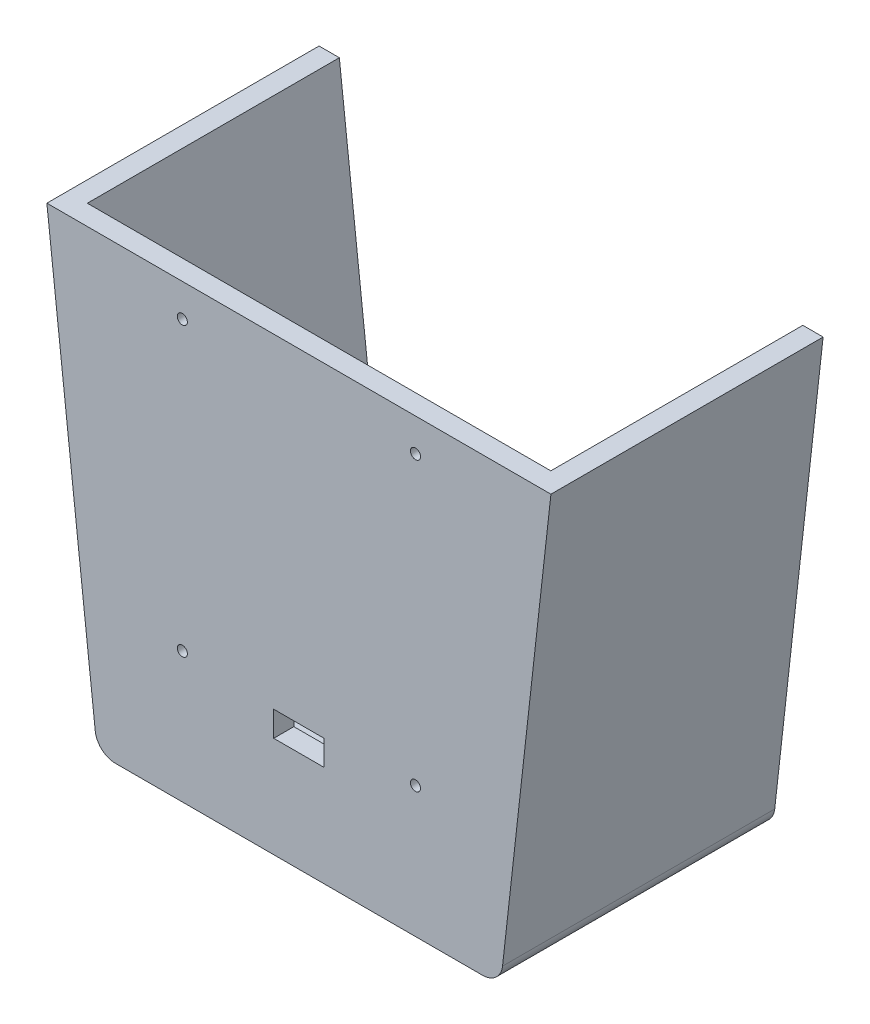
ISO-10303-21;
HEADER;
FILE_DESCRIPTION(('STEP AP214'),'2;1');
FILE_NAME('part.step','',(''),(''),'','','');
FILE_SCHEMA(('AUTOMOTIVE_DESIGN { 1 0 10303 214 1 1 1 1 }'));
ENDSEC;
DATA;
#1=APPLICATION_CONTEXT('core data for automotive mechanical design processes');
#2=APPLICATION_PROTOCOL_DEFINITION('international standard','automotive_design',2000,#1);
#3=PRODUCT_CONTEXT('',#1,'mechanical');
#4=PRODUCT('Part','Part','',(#3));
#5=PRODUCT_RELATED_PRODUCT_CATEGORY('part','',(#4));
#6=PRODUCT_DEFINITION_FORMATION('','',#4);
#7=PRODUCT_DEFINITION_CONTEXT('part definition',#1,'design');
#8=PRODUCT_DEFINITION('design','',#6,#7);
#9=PRODUCT_DEFINITION_SHAPE('','',#8);
#10=(LENGTH_UNIT() NAMED_UNIT(*) SI_UNIT(.MILLI.,.METRE.));
#11=(NAMED_UNIT(*) PLANE_ANGLE_UNIT() SI_UNIT($,.RADIAN.));
#12=(NAMED_UNIT(*) SI_UNIT($,.STERADIAN.) SOLID_ANGLE_UNIT());
#13=UNCERTAINTY_MEASURE_WITH_UNIT(LENGTH_MEASURE(1.E-05),#10,'distance_accuracy_value','');
#14=(GEOMETRIC_REPRESENTATION_CONTEXT(3) GLOBAL_UNCERTAINTY_ASSIGNED_CONTEXT((#13)) GLOBAL_UNIT_ASSIGNED_CONTEXT((#10,
#11,#12)) REPRESENTATION_CONTEXT('',''));
#15=CARTESIAN_POINT('',(0.,0.,0.));
#16=DIRECTION('',(0.,0.,1.));
#17=DIRECTION('',(1.,0.,0.));
#18=AXIS2_PLACEMENT_3D('',#15,#16,#17);
#19=CARTESIAN_POINT('',(46.2563098697204,-51.7161260569893,-5.08));
#20=DIRECTION('',(0.,0.,-1.));
#21=DIRECTION('',(-1.,0.,0.));
#22=AXIS2_PLACEMENT_3D('',#19,#20,#21);
#23=PLANE('',#22);
#24=CARTESIAN_POINT('',(-29.36937484,48.5411272,-5.08));
#25=DIRECTION('',(0.,0.,1.));
#26=DIRECTION('',(-1.,0.,0.));
#27=AXIS2_PLACEMENT_3D('',#24,#25,#26);
#28=CIRCLE('',#27,1.27);
#29=CARTESIAN_POINT('',(-30.63937484,48.5411272,-5.08));
#30=VERTEX_POINT('',#29);
#31=EDGE_CURVE('E774',#30,#30,#28,.T.);
#32=ORIENTED_EDGE('',*,*,#31,.T.);
#33=EDGE_LOOP('',(#32));
#34=FACE_BOUND('',#33,.T.);
#35=CARTESIAN_POINT('',(29.36937484,-23.8488716569893,-5.08));
#36=DIRECTION('',(0.,0.,1.));
#37=DIRECTION('',(-1.,0.,0.));
#38=AXIS2_PLACEMENT_3D('',#35,#36,#37);
#39=CIRCLE('',#38,1.27);
#40=CARTESIAN_POINT('',(28.09937484,-23.8488716569893,-5.08));
#41=VERTEX_POINT('',#40);
#42=EDGE_CURVE('E779',#41,#41,#39,.T.);
#43=ORIENTED_EDGE('',*,*,#42,.T.);
#44=EDGE_LOOP('',(#43));
#45=FACE_BOUND('',#44,.T.);
#46=CARTESIAN_POINT('',(-29.36937484,-23.8488716569893,-5.08));
#47=DIRECTION('',(0.,0.,1.));
#48=DIRECTION('',(1.,0.,0.));
#49=AXIS2_PLACEMENT_3D('',#46,#47,#48);
#50=CIRCLE('',#49,1.27);
#51=CARTESIAN_POINT('',(-28.09937484,-23.8488716569893,-5.08));
#52=VERTEX_POINT('',#51);
#53=EDGE_CURVE('E793',#52,#52,#50,.T.);
#54=ORIENTED_EDGE('',*,*,#53,.T.);
#55=EDGE_LOOP('',(#54));
#56=FACE_BOUND('',#55,.T.);
#57=CARTESIAN_POINT('',(29.36937484,48.5411272,-5.08));
#58=DIRECTION('',(0.,0.,1.));
#59=DIRECTION('',(1.,0.,0.));
#60=AXIS2_PLACEMENT_3D('',#57,#58,#59);
#61=CIRCLE('',#60,1.27);
#62=CARTESIAN_POINT('',(30.63937484,48.5411272,-5.08));
#63=VERTEX_POINT('',#62);
#64=EDGE_CURVE('E794',#63,#63,#61,.T.);
#65=ORIENTED_EDGE('',*,*,#64,.T.);
#66=EDGE_LOOP('',(#65));
#67=FACE_BOUND('',#66,.T.);
#68=DIRECTION('',(0.,-1.,0.));
#69=VECTOR('',#68,1.);
#70=CARTESIAN_POINT('',(-6.34999999999999,-25.0461260569893,-5.08));
#71=LINE('',#70,#69);
#72=CARTESIAN_POINT('',(-6.34999999999999,-25.0461260569893,-5.08));
#73=VERTEX_POINT('',#72);
#74=CARTESIAN_POINT('',(-6.34999999999999,-31.3961260569893,-5.08));
#75=VERTEX_POINT('',#74);
#76=EDGE_CURVE('E335',#73,#75,#71,.T.);
#77=ORIENTED_EDGE('',*,*,#76,.T.);
#78=DIRECTION('',(1.,0.,0.));
#79=VECTOR('',#78,1.);
#80=CARTESIAN_POINT('',(-6.34999999999999,-31.3961260569893,-5.08));
#81=LINE('',#80,#79);
#82=CARTESIAN_POINT('',(6.35000000000001,-31.3961260569893,-5.08));
#83=VERTEX_POINT('',#82);
#84=EDGE_CURVE('E339',#75,#83,#81,.T.);
#85=ORIENTED_EDGE('',*,*,#84,.T.);
#86=DIRECTION('',(0.,1.,0.));
#87=VECTOR('',#86,1.);
#88=CARTESIAN_POINT('',(6.35000000000001,-25.0461260569893,-5.08));
#89=LINE('',#88,#87);
#90=CARTESIAN_POINT('',(6.35000000000001,-25.0461260569893,-5.08));
#91=VERTEX_POINT('',#90);
#92=EDGE_CURVE('E344',#83,#91,#89,.T.);
#93=ORIENTED_EDGE('',*,*,#92,.T.);
#94=DIRECTION('',(-1.,0.,0.));
#95=VECTOR('',#94,1.);
#96=CARTESIAN_POINT('',(6.35000000000001,-25.0461260569893,-5.08));
#97=LINE('',#96,#95);
#98=EDGE_CURVE('E348',#91,#73,#97,.T.);
#99=ORIENTED_EDGE('',*,*,#98,.T.);
#100=EDGE_LOOP('',(#77,#85,#93,#99));
#101=FACE_BOUND('',#100,.T.);
#102=DIRECTION('',(-1.,0.,0.));
#103=VECTOR('',#102,1.);
#104=CARTESIAN_POINT('',(63.5,56.7961272,-5.08));
#105=LINE('',#104,#103);
#106=CARTESIAN_POINT('',(58.3883486034355,56.7961272,-5.08));
#107=VERTEX_POINT('',#106);
#108=CARTESIAN_POINT('',(-58.3883486034355,56.7961272,-5.08));
#109=VERTEX_POINT('',#108);
#110=EDGE_CURVE('E379',#107,#109,#105,.T.);
#111=ORIENTED_EDGE('',*,*,#110,.F.);
#112=DIRECTION('',(-0.111111111111111,-0.993807989999907,0.));
#113=VECTOR('',#112,1.);
#114=CARTESIAN_POINT('',(51.3958997921375,-5.74623628499934,-5.08));
#115=LINE('',#114,#113);
#116=CARTESIAN_POINT('',(46.7611643286404,-47.2005705014338,-5.08));
#117=VERTEX_POINT('',#116);
#118=EDGE_CURVE('E254',#107,#117,#115,.T.);
#119=ORIENTED_EDGE('',*,*,#118,.T.);
#120=CARTESIAN_POINT('',(41.7126197394409,-46.6361260569893,-5.08));
#121=DIRECTION('',(0.,0.,-1.));
#122=DIRECTION('',(-1.,0.,0.));
#123=AXIS2_PLACEMENT_3D('',#120,#121,#122);
#124=CIRCLE('',#123,5.08000000000001);
#125=CARTESIAN_POINT('',(41.7126197394409,-51.7161260569893,-5.08));
#126=VERTEX_POINT('',#125);
#127=EDGE_CURVE('E306',#117,#126,#124,.T.);
#128=ORIENTED_EDGE('',*,*,#127,.T.);
#129=DIRECTION('',(-1.,0.,0.));
#130=VECTOR('',#129,1.);
#131=CARTESIAN_POINT('',(0.,-51.7161260569893,-5.08));
#132=LINE('',#131,#130);
#133=CARTESIAN_POINT('',(-41.7126197394408,-51.7161260569893,-5.08));
#134=VERTEX_POINT('',#133);
#135=EDGE_CURVE('E303',#126,#134,#132,.T.);
#136=ORIENTED_EDGE('',*,*,#135,.T.);
#137=CARTESIAN_POINT('',(-41.7126197394408,-46.6361260569893,-5.08));
#138=DIRECTION('',(0.,0.,-1.));
#139=DIRECTION('',(-1.,0.,0.));
#140=AXIS2_PLACEMENT_3D('',#137,#138,#139);
#141=CIRCLE('',#140,5.08000000000001);
#142=CARTESIAN_POINT('',(-46.7611643286404,-47.2005705014338,-5.08));
#143=VERTEX_POINT('',#142);
#144=EDGE_CURVE('E299',#143,#134,#141,.F.);
#145=ORIENTED_EDGE('',*,*,#144,.F.);
#146=DIRECTION('',(0.111111111111111,-0.993807989999907,0.));
#147=VECTOR('',#146,1.);
#148=CARTESIAN_POINT('',(-51.3958997921375,-5.74623628499934,-5.08));
#149=LINE('',#148,#147);
#150=EDGE_CURVE('E248',#109,#143,#149,.T.);
#151=ORIENTED_EDGE('',*,*,#150,.F.);
#152=EDGE_LOOP('',(#111,#119,#128,#136,#145,#151));
#153=FACE_BOUND('',#152,.T.);
#154=DIRECTION('',(0.,-1.,0.));
#155=VECTOR('',#154,1.);
#156=CARTESIAN_POINT('',(20.3199970034355,44.0961272,-5.08));
#157=LINE('',#156,#155);
#158=CARTESIAN_POINT('',(20.3199970034355,44.0961272,-5.08));
#159=VERTEX_POINT('',#158);
#160=CARTESIAN_POINT('',(20.3199970034355,-19.4038728,-5.08));
#161=VERTEX_POINT('',#160);
#162=EDGE_CURVE('E221',#159,#161,#157,.T.);
#163=ORIENTED_EDGE('',*,*,#162,.F.);
#164=DIRECTION('',(0.539053696423367,0.842271400661511,0.));
#165=VECTOR('',#164,1.);
#166=CARTESIAN_POINT('',(20.3199970034355,44.0961272,-5.08));
#167=LINE('',#166,#165);
#168=CARTESIAN_POINT('',(17.7799970034355,40.1273772,-5.08));
#169=VERTEX_POINT('',#168);
#170=EDGE_CURVE('E213',#169,#159,#167,.T.);
#171=ORIENTED_EDGE('',*,*,#170,.F.);
#172=DIRECTION('',(0.,-1.,0.));
#173=VECTOR('',#172,1.);
#174=CARTESIAN_POINT('',(17.7799970034355,-16.8638728,-5.08));
#175=LINE('',#174,#173);
#176=CARTESIAN_POINT('',(17.7799970034355,-16.8638728,-5.08));
#177=VERTEX_POINT('',#176);
#178=EDGE_CURVE('E195',#169,#177,#175,.T.);
#179=ORIENTED_EDGE('',*,*,#178,.T.);
#180=DIRECTION('',(-1.,0.,0.));
#181=VECTOR('',#180,1.);
#182=CARTESIAN_POINT('',(-18.6944029965645,-16.8638728,-5.08));
#183=LINE('',#182,#181);
#184=CARTESIAN_POINT('',(-18.6944029965645,-16.8638728,-5.08));
#185=VERTEX_POINT('',#184);
#186=EDGE_CURVE('E206',#177,#185,#183,.T.);
#187=ORIENTED_EDGE('',*,*,#186,.T.);
#188=CARTESIAN_POINT('',(-20.3200029965645,-19.4038728,-5.08));
#189=VERTEX_POINT('',#188);
#190=EDGE_CURVE('E223',#189,#185,#167,.T.);
#191=ORIENTED_EDGE('',*,*,#190,.F.);
#192=DIRECTION('',(-1.,0.,0.));
#193=VECTOR('',#192,1.);
#194=CARTESIAN_POINT('',(20.3199970034355,-19.4038728,-5.08));
#195=LINE('',#194,#193);
#196=EDGE_CURVE('E235',#161,#189,#195,.T.);
#197=ORIENTED_EDGE('',*,*,#196,.F.);
#198=EDGE_LOOP('',(#163,#171,#179,#187,#191,#197));
#199=FACE_BOUND('',#198,.T.);
#200=ADVANCED_FACE('F43',(#34,#45,#56,#67,#101,#153,#199),#23,.T.);
#201=CARTESIAN_POINT('',(46.2563098697204,-51.7161260569893,-5.08));
#202=DIRECTION('',(0.,0.,1.));
#203=DIRECTION('',(1.,0.,0.));
#204=AXIS2_PLACEMENT_3D('',#201,#202,#203);
#205=CYLINDRICAL_SURFACE('',#204,5.08);
#206=CARTESIAN_POINT('',(46.2563098697204,-51.7161260569893,0.));
#207=DIRECTION('',(0.,0.,1.));
#208=DIRECTION('',(-1.,0.,0.));
#209=AXIS2_PLACEMENT_3D('',#206,#207,#208);
#210=CIRCLE('',#209,5.08);
#211=CARTESIAN_POINT('',(46.2563098697204,-56.7961260569893,0.));
#212=VERTEX_POINT('',#211);
#213=CARTESIAN_POINT('',(51.30485445892,-52.2805705014337,0.));
#214=VERTEX_POINT('',#213);
#215=EDGE_CURVE('E369',#212,#214,#210,.T.);
#216=ORIENTED_EDGE('',*,*,#215,.F.);
#217=DIRECTION('',(0.,0.,1.));
#218=VECTOR('',#217,1.);
#219=CARTESIAN_POINT('',(46.2563098697204,-56.7961260569893,-5.08));
#220=LINE('',#219,#218);
#221=CARTESIAN_POINT('',(46.2563098697204,-56.7961260569893,-68.58));
#222=VERTEX_POINT('',#221);
#223=EDGE_CURVE('E11',#222,#212,#220,.T.);
#224=ORIENTED_EDGE('',*,*,#223,.F.);
#225=CARTESIAN_POINT('',(46.2563098697204,-51.7161260569893,-68.58));
#226=DIRECTION('',(0.,0.,-1.));
#227=DIRECTION('',(-1.,0.,0.));
#228=AXIS2_PLACEMENT_3D('',#225,#226,#227);
#229=CIRCLE('',#228,5.08);
#230=CARTESIAN_POINT('',(51.30485445892,-52.2805705014338,-68.58));
#231=VERTEX_POINT('',#230);
#232=EDGE_CURVE('E291',#231,#222,#229,.T.);
#233=ORIENTED_EDGE('',*,*,#232,.F.);
#234=DIRECTION('',(0.,0.,1.));
#235=VECTOR('',#234,1.);
#236=CARTESIAN_POINT('',(51.30485445892,-52.2805705014337,-5.08));
#237=LINE('',#236,#235);
#238=EDGE_CURVE('E47',#231,#214,#237,.T.);
#239=ORIENTED_EDGE('',*,*,#238,.T.);
#240=EDGE_LOOP('',(#216,#224,#233,#239));
#241=FACE_BOUND('',#240,.T.);
#242=ADVANCED_FACE('F45',(#241),#205,.T.);
#243=CARTESIAN_POINT('',(-46.2563098697204,-56.7961260569893,-5.08));
#244=DIRECTION('',(0.,-1.,0.));
#245=DIRECTION('',(0.,0.,-1.));
#246=AXIS2_PLACEMENT_3D('',#243,#244,#245);
#247=PLANE('',#246);
#248=DIRECTION('',(1.,0.,0.));
#249=VECTOR('',#248,1.);
#250=CARTESIAN_POINT('',(-46.2563098697204,-56.7961260569893,0.));
#251=LINE('',#250,#249);
#252=CARTESIAN_POINT('',(-46.2563098697204,-56.7961260569893,0.));
#253=VERTEX_POINT('',#252);
#254=EDGE_CURVE('E383',#253,#212,#251,.T.);
#255=ORIENTED_EDGE('',*,*,#254,.F.);
#256=DIRECTION('',(0.,0.,1.));
#257=VECTOR('',#256,1.);
#258=CARTESIAN_POINT('',(-46.2563098697204,-56.7961260569893,-5.08));
#259=LINE('',#258,#257);
#260=CARTESIAN_POINT('',(-46.2563098697204,-56.7961260569893,-68.58));
#261=VERTEX_POINT('',#260);
#262=EDGE_CURVE('E53',#261,#253,#259,.T.);
#263=ORIENTED_EDGE('',*,*,#262,.F.);
#264=DIRECTION('',(-1.,0.,0.));
#265=VECTOR('',#264,1.);
#266=CARTESIAN_POINT('',(0.,-56.7961260569893,-68.58));
#267=LINE('',#266,#265);
#268=EDGE_CURVE('E249',#222,#261,#267,.T.);
#269=ORIENTED_EDGE('',*,*,#268,.F.);
#270=ORIENTED_EDGE('',*,*,#223,.T.);
#271=EDGE_LOOP('',(#255,#263,#269,#270));
#272=FACE_BOUND('',#271,.T.);
#273=ADVANCED_FACE('F429',(#272),#247,.T.);
#274=CARTESIAN_POINT('',(-46.2563098697204,-51.7161260569893,-5.08));
#275=DIRECTION('',(0.,0.,1.));
#276=DIRECTION('',(1.,0.,0.));
#277=AXIS2_PLACEMENT_3D('',#274,#275,#276);
#278=CYLINDRICAL_SURFACE('',#277,5.08);
#279=CARTESIAN_POINT('',(-46.2563098697204,-51.7161260569893,0.));
#280=DIRECTION('',(0.,0.,1.));
#281=DIRECTION('',(1.,0.,0.));
#282=AXIS2_PLACEMENT_3D('',#279,#280,#281);
#283=CIRCLE('',#282,5.08);
#284=CARTESIAN_POINT('',(-51.3048544589199,-52.2805705014337,0.));
#285=VERTEX_POINT('',#284);
#286=EDGE_CURVE('E399',#285,#253,#283,.T.);
#287=ORIENTED_EDGE('',*,*,#286,.F.);
#288=DIRECTION('',(0.,0.,1.));
#289=VECTOR('',#288,1.);
#290=CARTESIAN_POINT('',(-51.3048544589199,-52.2805705014337,-5.08));
#291=LINE('',#290,#289);
#292=CARTESIAN_POINT('',(-51.3048544589199,-52.2805705014337,-68.58));
#293=VERTEX_POINT('',#292);
#294=EDGE_CURVE('E408',#293,#285,#291,.T.);
#295=ORIENTED_EDGE('',*,*,#294,.F.);
#296=CARTESIAN_POINT('',(-46.2563098697204,-51.7161260569893,-68.58));
#297=DIRECTION('',(0.,0.,-1.));
#298=DIRECTION('',(-1.,0.,0.));
#299=AXIS2_PLACEMENT_3D('',#296,#297,#298);
#300=CIRCLE('',#299,5.08);
#301=EDGE_CURVE('E253',#261,#293,#300,.T.);
#302=ORIENTED_EDGE('',*,*,#301,.F.);
#303=ORIENTED_EDGE('',*,*,#262,.T.);
#304=EDGE_LOOP('',(#287,#295,#302,#303));
#305=FACE_BOUND('',#304,.T.);
#306=ADVANCED_FACE('F446',(#305),#278,.T.);
#307=CARTESIAN_POINT('',(-63.5,56.7961272,-5.08));
#308=DIRECTION('',(-0.993807989999906,-0.111111111111111,0.));
#309=DIRECTION('',(0.111111111111111,-0.993807989999906,0.));
#310=AXIS2_PLACEMENT_3D('',#307,#308,#309);
#311=PLANE('',#310);
#312=DIRECTION('',(0.111111111111111,-0.993807989999906,0.));
#313=VECTOR('',#312,1.);
#314=CARTESIAN_POINT('',(-63.5,56.7961272,0.));
#315=LINE('',#314,#313);
#316=CARTESIAN_POINT('',(-63.5,56.7961272,0.));
#317=VERTEX_POINT('',#316);
#318=EDGE_CURVE('E395',#317,#285,#315,.T.);
#319=ORIENTED_EDGE('',*,*,#318,.F.);
#320=DIRECTION('',(0.,0.,1.));
#321=VECTOR('',#320,1.);
#322=CARTESIAN_POINT('',(-63.5,56.7961272,-5.08));
#323=LINE('',#322,#321);
#324=CARTESIAN_POINT('',(-63.5,56.7961272,-68.58));
#325=VERTEX_POINT('',#324);
#326=EDGE_CURVE('E411',#325,#317,#323,.T.);
#327=ORIENTED_EDGE('',*,*,#326,.F.);
#328=DIRECTION('',(-0.111111111111111,0.993807989999907,0.));
#329=VECTOR('',#328,1.);
#330=CARTESIAN_POINT('',(-56.444444381337,-6.31068072944379,-68.58));
#331=LINE('',#330,#329);
#332=EDGE_CURVE('E258',#293,#325,#331,.T.);
#333=ORIENTED_EDGE('',*,*,#332,.F.);
#334=ORIENTED_EDGE('',*,*,#294,.T.);
#335=EDGE_LOOP('',(#319,#327,#333,#334));
#336=FACE_BOUND('',#335,.T.);
#337=ADVANCED_FACE('F443',(#336),#311,.T.);
#338=CARTESIAN_POINT('',(63.5,56.7961272,-5.08));
#339=DIRECTION('',(0.,1.,0.));
#340=DIRECTION('',(-1.,0.,0.));
#341=AXIS2_PLACEMENT_3D('',#338,#339,#340);
#342=PLANE('',#341);
#343=DIRECTION('',(-1.,0.,0.));
#344=VECTOR('',#343,1.);
#345=CARTESIAN_POINT('',(63.5,56.7961272,0.));
#346=LINE('',#345,#344);
#347=CARTESIAN_POINT('',(63.5,56.7961272,0.));
#348=VERTEX_POINT('',#347);
#349=EDGE_CURVE('E391',#348,#317,#346,.T.);
#350=ORIENTED_EDGE('',*,*,#349,.F.);
#351=DIRECTION('',(0.,0.,1.));
#352=VECTOR('',#351,1.);
#353=CARTESIAN_POINT('',(63.5,56.7961272,-5.08));
#354=LINE('',#353,#352);
#355=CARTESIAN_POINT('',(63.5,56.7961272,-68.58));
#356=VERTEX_POINT('',#355);
#357=EDGE_CURVE('E413',#356,#348,#354,.T.);
#358=ORIENTED_EDGE('',*,*,#357,.F.);
#359=DIRECTION('',(1.,0.,0.));
#360=VECTOR('',#359,1.);
#361=CARTESIAN_POINT('',(0.,56.7961272,-68.58));
#362=LINE('',#361,#360);
#363=CARTESIAN_POINT('',(58.3883486034355,56.7961272,-68.58));
#364=VERTEX_POINT('',#363);
#365=EDGE_CURVE('E283',#364,#356,#362,.T.);
#366=ORIENTED_EDGE('',*,*,#365,.F.);
#367=DIRECTION('',(0.,0.,1.));
#368=VECTOR('',#367,1.);
#369=CARTESIAN_POINT('',(58.3883486034355,56.7961272,-68.58));
#370=LINE('',#369,#368);
#371=EDGE_CURVE('E295',#364,#107,#370,.T.);
#372=ORIENTED_EDGE('',*,*,#371,.T.);
#373=ORIENTED_EDGE('',*,*,#110,.T.);
#374=DIRECTION('',(0.,0.,1.));
#375=VECTOR('',#374,1.);
#376=CARTESIAN_POINT('',(-58.3883486034355,56.7961272,-68.58));
#377=LINE('',#376,#375);
#378=CARTESIAN_POINT('',(-58.3883486034355,56.7961272,-68.58));
#379=VERTEX_POINT('',#378);
#380=EDGE_CURVE('E330',#379,#109,#377,.T.);
#381=ORIENTED_EDGE('',*,*,#380,.F.);
#382=DIRECTION('',(1.,0.,0.));
#383=VECTOR('',#382,1.);
#384=CARTESIAN_POINT('',(0.,56.7961272,-68.58));
#385=LINE('',#384,#383);
#386=EDGE_CURVE('E262',#325,#379,#385,.T.);
#387=ORIENTED_EDGE('',*,*,#386,.F.);
#388=ORIENTED_EDGE('',*,*,#326,.T.);
#389=EDGE_LOOP('',(#350,#358,#366,#372,#373,#381,#387,#388));
#390=FACE_BOUND('',#389,.T.);
#391=ADVANCED_FACE('F438',(#390),#342,.T.);
#392=CARTESIAN_POINT('',(63.5,56.7961272,-5.08));
#393=DIRECTION('',(0.993807989999906,-0.111111111111111,0.));
#394=DIRECTION('',(0.111111111111111,0.993807989999907,0.));
#395=AXIS2_PLACEMENT_3D('',#392,#393,#394);
#396=PLANE('',#395);
#397=DIRECTION('',(0.111111111111111,0.993807989999907,0.));
#398=VECTOR('',#397,1.);
#399=CARTESIAN_POINT('',(63.5,56.7961272,0.));
#400=LINE('',#399,#398);
#401=EDGE_CURVE('E387',#214,#348,#400,.T.);
#402=ORIENTED_EDGE('',*,*,#401,.F.);
#403=ORIENTED_EDGE('',*,*,#238,.F.);
#404=DIRECTION('',(-0.111111111111111,-0.993807989999907,0.));
#405=VECTOR('',#404,1.);
#406=CARTESIAN_POINT('',(56.444444381337,-6.31068072944378,-68.58));
#407=LINE('',#406,#405);
#408=EDGE_CURVE('E287',#356,#231,#407,.T.);
#409=ORIENTED_EDGE('',*,*,#408,.F.);
#410=ORIENTED_EDGE('',*,*,#357,.T.);
#411=EDGE_LOOP('',(#402,#403,#409,#410));
#412=FACE_BOUND('',#411,.T.);
#413=ADVANCED_FACE('F423',(#412),#396,.T.);
#414=CARTESIAN_POINT('',(46.2563098697204,-51.7161260569893,0.));
#415=DIRECTION('',(0.,0.,-1.));
#416=DIRECTION('',(-1.,0.,0.));
#417=AXIS2_PLACEMENT_3D('',#414,#415,#416);
#418=PLANE('',#417);
#419=CARTESIAN_POINT('',(-29.36937484,48.5411272,0.));
#420=DIRECTION('',(0.,0.,1.));
#421=DIRECTION('',(-1.,0.,0.));
#422=AXIS2_PLACEMENT_3D('',#419,#420,#421);
#423=CIRCLE('',#422,1.27);
#424=CARTESIAN_POINT('',(-30.63937484,48.5411272,0.));
#425=VERTEX_POINT('',#424);
#426=EDGE_CURVE('E777',#425,#425,#423,.T.);
#427=ORIENTED_EDGE('',*,*,#426,.F.);
#428=EDGE_LOOP('',(#427));
#429=FACE_BOUND('',#428,.T.);
#430=CARTESIAN_POINT('',(29.36937484,-23.8488716569893,0.));
#431=DIRECTION('',(0.,0.,1.));
#432=DIRECTION('',(-1.,0.,0.));
#433=AXIS2_PLACEMENT_3D('',#430,#431,#432);
#434=CIRCLE('',#433,1.27);
#435=CARTESIAN_POINT('',(28.09937484,-23.8488716569893,0.));
#436=VERTEX_POINT('',#435);
#437=EDGE_CURVE('E786',#436,#436,#434,.T.);
#438=ORIENTED_EDGE('',*,*,#437,.F.);
#439=EDGE_LOOP('',(#438));
#440=FACE_BOUND('',#439,.T.);
#441=CARTESIAN_POINT('',(-29.36937484,-23.8488716569893,0.));
#442=DIRECTION('',(0.,0.,1.));
#443=DIRECTION('',(1.,0.,0.));
#444=AXIS2_PLACEMENT_3D('',#441,#442,#443);
#445=CIRCLE('',#444,1.27);
#446=CARTESIAN_POINT('',(-28.09937484,-23.8488716569893,0.));
#447=VERTEX_POINT('',#446);
#448=EDGE_CURVE('E839',#447,#447,#445,.T.);
#449=ORIENTED_EDGE('',*,*,#448,.F.);
#450=EDGE_LOOP('',(#449));
#451=FACE_BOUND('',#450,.T.);
#452=CARTESIAN_POINT('',(29.36937484,48.5411272,0.));
#453=DIRECTION('',(0.,0.,1.));
#454=DIRECTION('',(1.,0.,0.));
#455=AXIS2_PLACEMENT_3D('',#452,#453,#454);
#456=CIRCLE('',#455,1.27);
#457=CARTESIAN_POINT('',(30.63937484,48.5411272,0.));
#458=VERTEX_POINT('',#457);
#459=EDGE_CURVE('E783',#458,#458,#456,.T.);
#460=ORIENTED_EDGE('',*,*,#459,.F.);
#461=EDGE_LOOP('',(#460));
#462=FACE_BOUND('',#461,.T.);
#463=DIRECTION('',(1.,0.,0.));
#464=VECTOR('',#463,1.);
#465=CARTESIAN_POINT('',(-6.34999999999999,-31.3961260569893,0.));
#466=LINE('',#465,#464);
#467=CARTESIAN_POINT('',(-6.34999999999999,-31.3961260569893,0.));
#468=VERTEX_POINT('',#467);
#469=CARTESIAN_POINT('',(6.35000000000001,-31.3961260569893,0.));
#470=VERTEX_POINT('',#469);
#471=EDGE_CURVE('E355',#468,#470,#466,.T.);
#472=ORIENTED_EDGE('',*,*,#471,.F.);
#473=DIRECTION('',(0.,-1.,0.));
#474=VECTOR('',#473,1.);
#475=CARTESIAN_POINT('',(-6.34999999999999,-25.0461260569893,0.));
#476=LINE('',#475,#474);
#477=CARTESIAN_POINT('',(-6.34999999999999,-25.0461260569893,0.));
#478=VERTEX_POINT('',#477);
#479=EDGE_CURVE('E334',#478,#468,#476,.T.);
#480=ORIENTED_EDGE('',*,*,#479,.F.);
#481=DIRECTION('',(-1.,0.,0.));
#482=VECTOR('',#481,1.);
#483=CARTESIAN_POINT('',(6.35000000000001,-25.0461260569893,0.));
#484=LINE('',#483,#482);
#485=CARTESIAN_POINT('',(6.35000000000001,-25.0461260569893,0.));
#486=VERTEX_POINT('',#485);
#487=EDGE_CURVE('E340',#486,#478,#484,.T.);
#488=ORIENTED_EDGE('',*,*,#487,.F.);
#489=DIRECTION('',(0.,1.,0.));
#490=VECTOR('',#489,1.);
#491=CARTESIAN_POINT('',(6.35000000000001,-25.0461260569893,0.));
#492=LINE('',#491,#490);
#493=EDGE_CURVE('E359',#470,#486,#492,.T.);
#494=ORIENTED_EDGE('',*,*,#493,.F.);
#495=EDGE_LOOP('',(#472,#480,#488,#494));
#496=FACE_BOUND('',#495,.T.);
#497=ORIENTED_EDGE('',*,*,#215,.T.);
#498=ORIENTED_EDGE('',*,*,#401,.T.);
#499=ORIENTED_EDGE('',*,*,#349,.T.);
#500=ORIENTED_EDGE('',*,*,#318,.T.);
#501=ORIENTED_EDGE('',*,*,#286,.T.);
#502=ORIENTED_EDGE('',*,*,#254,.T.);
#503=EDGE_LOOP('',(#497,#498,#499,#500,#501,#502));
#504=FACE_BOUND('',#503,.T.);
#505=ADVANCED_FACE('F425',(#429,#440,#451,#462,#496,#504),#418,.F.);
#506=CARTESIAN_POINT('',(-6.34999999999999,-25.0461260569893,-5.08));
#507=DIRECTION('',(-1.,0.,0.));
#508=DIRECTION('',(0.,-1.,0.));
#509=AXIS2_PLACEMENT_3D('',#506,#507,#508);
#510=PLANE('',#509);
#511=ORIENTED_EDGE('',*,*,#479,.T.);
#512=DIRECTION('',(0.,0.,1.));
#513=VECTOR('',#512,1.);
#514=CARTESIAN_POINT('',(-6.34999999999999,-31.3961260569893,-5.08));
#515=LINE('',#514,#513);
#516=EDGE_CURVE('E352',#75,#468,#515,.T.);
#517=ORIENTED_EDGE('',*,*,#516,.F.);
#518=ORIENTED_EDGE('',*,*,#76,.F.);
#519=DIRECTION('',(0.,0.,1.));
#520=VECTOR('',#519,1.);
#521=CARTESIAN_POINT('',(-6.34999999999999,-25.0461260569893,-5.08));
#522=LINE('',#521,#520);
#523=EDGE_CURVE('E366',#73,#478,#522,.T.);
#524=ORIENTED_EDGE('',*,*,#523,.T.);
#525=EDGE_LOOP('',(#511,#517,#518,#524));
#526=FACE_BOUND('',#525,.T.);
#527=ADVANCED_FACE('F476',(#526),#510,.F.);
#528=CARTESIAN_POINT('',(6.35000000000001,-25.0461260569893,-5.08));
#529=DIRECTION('',(0.,1.,0.));
#530=DIRECTION('',(0.,0.,1.));
#531=AXIS2_PLACEMENT_3D('',#528,#529,#530);
#532=PLANE('',#531);
#533=ORIENTED_EDGE('',*,*,#487,.T.);
#534=ORIENTED_EDGE('',*,*,#523,.F.);
#535=ORIENTED_EDGE('',*,*,#98,.F.);
#536=DIRECTION('',(0.,0.,1.));
#537=VECTOR('',#536,1.);
#538=CARTESIAN_POINT('',(6.35000000000001,-25.0461260569893,-5.08));
#539=LINE('',#538,#537);
#540=EDGE_CURVE('E370',#91,#486,#539,.T.);
#541=ORIENTED_EDGE('',*,*,#540,.T.);
#542=EDGE_LOOP('',(#533,#534,#535,#541));
#543=FACE_BOUND('',#542,.T.);
#544=ADVANCED_FACE('F505',(#543),#532,.F.);
#545=CARTESIAN_POINT('',(6.35000000000001,-25.0461260569893,-5.08));
#546=DIRECTION('',(1.,0.,0.));
#547=DIRECTION('',(0.,1.,0.));
#548=AXIS2_PLACEMENT_3D('',#545,#546,#547);
#549=PLANE('',#548);
#550=ORIENTED_EDGE('',*,*,#493,.T.);
#551=ORIENTED_EDGE('',*,*,#540,.F.);
#552=ORIENTED_EDGE('',*,*,#92,.F.);
#553=DIRECTION('',(0.,0.,1.));
#554=VECTOR('',#553,1.);
#555=CARTESIAN_POINT('',(6.35000000000001,-31.3961260569893,-5.08));
#556=LINE('',#555,#554);
#557=EDGE_CURVE('E373',#83,#470,#556,.T.);
#558=ORIENTED_EDGE('',*,*,#557,.T.);
#559=EDGE_LOOP('',(#550,#551,#552,#558));
#560=FACE_BOUND('',#559,.T.);
#561=ADVANCED_FACE('F512',(#560),#549,.F.);
#562=CARTESIAN_POINT('',(-6.34999999999999,-31.3961260569893,-5.08));
#563=DIRECTION('',(0.,-1.,0.));
#564=DIRECTION('',(0.,0.,-1.));
#565=AXIS2_PLACEMENT_3D('',#562,#563,#564);
#566=PLANE('',#565);
#567=ORIENTED_EDGE('',*,*,#471,.T.);
#568=ORIENTED_EDGE('',*,*,#557,.F.);
#569=ORIENTED_EDGE('',*,*,#84,.F.);
#570=ORIENTED_EDGE('',*,*,#516,.T.);
#571=EDGE_LOOP('',(#567,#568,#569,#570));
#572=FACE_BOUND('',#571,.T.);
#573=ADVANCED_FACE('F520',(#572),#566,.F.);
#574=CARTESIAN_POINT('',(-51.3958997921375,-5.74623628499934,-68.58));
#575=DIRECTION('',(-0.993807989999906,-0.111111111111111,0.));
#576=DIRECTION('',(0.111111111111111,-0.993807989999906,0.));
#577=AXIS2_PLACEMENT_3D('',#574,#575,#576);
#578=PLANE('',#577);
#579=ORIENTED_EDGE('',*,*,#150,.T.);
#580=DIRECTION('',(0.,0.,1.));
#581=VECTOR('',#580,1.);
#582=CARTESIAN_POINT('',(-46.7611643286404,-47.2005705014338,-68.58));
#583=LINE('',#582,#581);
#584=CARTESIAN_POINT('',(-46.7611643286404,-47.2005705014338,-68.58));
#585=VERTEX_POINT('',#584);
#586=EDGE_CURVE('E326',#585,#143,#583,.T.);
#587=ORIENTED_EDGE('',*,*,#586,.F.);
#588=DIRECTION('',(0.111111111111111,-0.993807989999907,0.));
#589=VECTOR('',#588,1.);
#590=CARTESIAN_POINT('',(-51.3958997921375,-5.74623628499934,-68.58));
#591=LINE('',#590,#589);
#592=EDGE_CURVE('E265',#379,#585,#591,.T.);
#593=ORIENTED_EDGE('',*,*,#592,.F.);
#594=ORIENTED_EDGE('',*,*,#380,.T.);
#595=EDGE_LOOP('',(#579,#587,#593,#594));
#596=FACE_BOUND('',#595,.T.);
#597=ADVANCED_FACE('F451',(#596),#578,.F.);
#598=CARTESIAN_POINT('',(-41.7126197394408,-46.6361260569893,-68.58));
#599=DIRECTION('',(0.,0.,1.));
#600=DIRECTION('',(1.,0.,0.));
#601=AXIS2_PLACEMENT_3D('',#598,#599,#600);
#602=CYLINDRICAL_SURFACE('',#601,5.08000000000001);
#603=ORIENTED_EDGE('',*,*,#144,.T.);
#604=DIRECTION('',(0.,0.,1.));
#605=VECTOR('',#604,1.);
#606=CARTESIAN_POINT('',(-41.7126197394408,-51.7161260569893,-68.58));
#607=LINE('',#606,#605);
#608=CARTESIAN_POINT('',(-41.7126197394408,-51.7161260569893,-68.58));
#609=VERTEX_POINT('',#608);
#610=EDGE_CURVE('E322',#609,#134,#607,.T.);
#611=ORIENTED_EDGE('',*,*,#610,.F.);
#612=CARTESIAN_POINT('',(-41.7126197394408,-46.6361260569893,-68.58));
#613=DIRECTION('',(0.,0.,-1.));
#614=DIRECTION('',(-1.,0.,0.));
#615=AXIS2_PLACEMENT_3D('',#612,#613,#614);
#616=CIRCLE('',#615,5.08000000000001);
#617=EDGE_CURVE('E268',#585,#609,#616,.F.);
#618=ORIENTED_EDGE('',*,*,#617,.F.);
#619=ORIENTED_EDGE('',*,*,#586,.T.);
#620=EDGE_LOOP('',(#603,#611,#618,#619));
#621=FACE_BOUND('',#620,.T.);
#622=ADVANCED_FACE('F456',(#621),#602,.F.);
#623=CARTESIAN_POINT('',(0.,-51.7161260569893,-68.58));
#624=DIRECTION('',(0.,1.,0.));
#625=DIRECTION('',(0.,0.,1.));
#626=AXIS2_PLACEMENT_3D('',#623,#624,#625);
#627=PLANE('',#626);
#628=ORIENTED_EDGE('',*,*,#135,.F.);
#629=DIRECTION('',(0.,0.,1.));
#630=VECTOR('',#629,1.);
#631=CARTESIAN_POINT('',(41.7126197394409,-51.7161260569893,-68.58));
#632=LINE('',#631,#630);
#633=CARTESIAN_POINT('',(41.7126197394409,-51.7161260569893,-68.58));
#634=VERTEX_POINT('',#633);
#635=EDGE_CURVE('E318',#634,#126,#632,.T.);
#636=ORIENTED_EDGE('',*,*,#635,.F.);
#637=DIRECTION('',(-1.,0.,0.));
#638=VECTOR('',#637,1.);
#639=CARTESIAN_POINT('',(0.,-51.7161260569893,-68.58));
#640=LINE('',#639,#638);
#641=EDGE_CURVE('E271',#634,#609,#640,.T.);
#642=ORIENTED_EDGE('',*,*,#641,.T.);
#643=ORIENTED_EDGE('',*,*,#610,.T.);
#644=EDGE_LOOP('',(#628,#636,#642,#643));
#645=FACE_BOUND('',#644,.T.);
#646=ADVANCED_FACE('F459',(#645),#627,.T.);
#647=CARTESIAN_POINT('',(41.7126197394409,-46.6361260569893,-68.58));
#648=DIRECTION('',(0.,0.,1.));
#649=DIRECTION('',(1.,0.,0.));
#650=AXIS2_PLACEMENT_3D('',#647,#648,#649);
#651=CYLINDRICAL_SURFACE('',#650,5.08000000000001);
#652=ORIENTED_EDGE('',*,*,#127,.F.);
#653=DIRECTION('',(0.,0.,1.));
#654=VECTOR('',#653,1.);
#655=CARTESIAN_POINT('',(46.7611643286404,-47.2005705014338,-68.58));
#656=LINE('',#655,#654);
#657=CARTESIAN_POINT('',(46.7611643286404,-47.2005705014338,-68.58));
#658=VERTEX_POINT('',#657);
#659=EDGE_CURVE('E314',#658,#117,#656,.T.);
#660=ORIENTED_EDGE('',*,*,#659,.F.);
#661=CARTESIAN_POINT('',(41.7126197394409,-46.6361260569893,-68.58));
#662=DIRECTION('',(0.,0.,-1.));
#663=DIRECTION('',(-1.,0.,0.));
#664=AXIS2_PLACEMENT_3D('',#661,#662,#663);
#665=CIRCLE('',#664,5.08000000000001);
#666=EDGE_CURVE('E275',#658,#634,#665,.T.);
#667=ORIENTED_EDGE('',*,*,#666,.T.);
#668=ORIENTED_EDGE('',*,*,#635,.T.);
#669=EDGE_LOOP('',(#652,#660,#667,#668));
#670=FACE_BOUND('',#669,.T.);
#671=ADVANCED_FACE('F462',(#670),#651,.F.);
#672=CARTESIAN_POINT('',(51.3958997921375,-5.74623628499934,-68.58));
#673=DIRECTION('',(-0.993807989999906,0.111111111111111,0.));
#674=DIRECTION('',(-0.111111111111111,-0.993807989999906,0.));
#675=AXIS2_PLACEMENT_3D('',#672,#673,#674);
#676=PLANE('',#675);
#677=ORIENTED_EDGE('',*,*,#118,.F.);
#678=ORIENTED_EDGE('',*,*,#371,.F.);
#679=DIRECTION('',(-0.111111111111111,-0.993807989999907,0.));
#680=VECTOR('',#679,1.);
#681=CARTESIAN_POINT('',(51.3958997921375,-5.74623628499934,-68.58));
#682=LINE('',#681,#680);
#683=EDGE_CURVE('E279',#364,#658,#682,.T.);
#684=ORIENTED_EDGE('',*,*,#683,.T.);
#685=ORIENTED_EDGE('',*,*,#659,.T.);
#686=EDGE_LOOP('',(#677,#678,#684,#685));
#687=FACE_BOUND('',#686,.T.);
#688=ADVANCED_FACE('F464',(#687),#676,.T.);
#689=CARTESIAN_POINT('',(0.,0.,-68.58));
#690=DIRECTION('',(0.,0.,-1.));
#691=DIRECTION('',(-1.,0.,0.));
#692=AXIS2_PLACEMENT_3D('',#689,#690,#691);
#693=PLANE('',#692);
#694=ORIENTED_EDGE('',*,*,#268,.T.);
#695=ORIENTED_EDGE('',*,*,#301,.T.);
#696=ORIENTED_EDGE('',*,*,#332,.T.);
#697=ORIENTED_EDGE('',*,*,#386,.T.);
#698=ORIENTED_EDGE('',*,*,#592,.T.);
#699=ORIENTED_EDGE('',*,*,#617,.T.);
#700=ORIENTED_EDGE('',*,*,#641,.F.);
#701=ORIENTED_EDGE('',*,*,#666,.F.);
#702=ORIENTED_EDGE('',*,*,#683,.F.);
#703=ORIENTED_EDGE('',*,*,#365,.T.);
#704=ORIENTED_EDGE('',*,*,#408,.T.);
#705=ORIENTED_EDGE('',*,*,#232,.T.);
#706=EDGE_LOOP('',(#694,#695,#696,#697,#698,#699,#700,#701,#702,#703,#704,#705));
#707=FACE_BOUND('',#706,.T.);
#708=ADVANCED_FACE('F433',(#707),#693,.T.);
#709=CARTESIAN_POINT('',(20.3199970034355,44.0961272,-15.24));
#710=DIRECTION('',(0.842271400661511,-0.539053696423367,0.));
#711=DIRECTION('',(0.539053696423367,0.842271400661511,0.));
#712=AXIS2_PLACEMENT_3D('',#709,#710,#711);
#713=PLANE('',#712);
#714=ORIENTED_EDGE('',*,*,#190,.T.);
#715=DIRECTION('',(0.,0.,-1.));
#716=VECTOR('',#715,1.);
#717=CARTESIAN_POINT('',(-18.6944029965645,-16.8638728,-5.08));
#718=LINE('',#717,#716);
#719=CARTESIAN_POINT('',(-18.6944029965645,-16.8638728,-12.7));
#720=VERTEX_POINT('',#719);
#721=EDGE_CURVE('E224',#185,#720,#718,.T.);
#722=ORIENTED_EDGE('',*,*,#721,.T.);
#723=DIRECTION('',(0.539053696423368,0.842271400661511,0.));
#724=VECTOR('',#723,1.);
#725=CARTESIAN_POINT('',(17.7799970034355,40.1273772,-12.7));
#726=LINE('',#725,#724);
#727=CARTESIAN_POINT('',(17.7799970034355,40.1273772,-12.7));
#728=VERTEX_POINT('',#727);
#729=EDGE_CURVE('E216',#720,#728,#726,.T.);
#730=ORIENTED_EDGE('',*,*,#729,.T.);
#731=DIRECTION('',(0.,0.,-1.));
#732=VECTOR('',#731,1.);
#733=CARTESIAN_POINT('',(17.7799970034355,40.1273772,-5.08));
#734=LINE('',#733,#732);
#735=EDGE_CURVE('E198',#169,#728,#734,.T.);
#736=ORIENTED_EDGE('',*,*,#735,.F.);
#737=ORIENTED_EDGE('',*,*,#170,.T.);
#738=DIRECTION('',(0.,0.,1.));
#739=VECTOR('',#738,1.);
#740=CARTESIAN_POINT('',(20.3199970034355,44.0961272,-15.24));
#741=LINE('',#740,#739);
#742=CARTESIAN_POINT('',(20.3199970034355,44.0961272,-15.24));
#743=VERTEX_POINT('',#742);
#744=EDGE_CURVE('E245',#743,#159,#741,.T.);
#745=ORIENTED_EDGE('',*,*,#744,.F.);
#746=DIRECTION('',(0.539053696423367,0.842271400661511,0.));
#747=VECTOR('',#746,1.);
#748=CARTESIAN_POINT('',(20.3199970034355,44.0961272,-15.24));
#749=LINE('',#748,#747);
#750=CARTESIAN_POINT('',(-20.3200029965645,-19.4038728,-15.24));
#751=VERTEX_POINT('',#750);
#752=EDGE_CURVE('E238',#751,#743,#749,.T.);
#753=ORIENTED_EDGE('',*,*,#752,.F.);
#754=DIRECTION('',(0.,0.,1.));
#755=VECTOR('',#754,1.);
#756=CARTESIAN_POINT('',(-20.3200029965645,-19.4038728,-15.24));
#757=LINE('',#756,#755);
#758=EDGE_CURVE('E239',#751,#189,#757,.T.);
#759=ORIENTED_EDGE('',*,*,#758,.T.);
#760=EDGE_LOOP('',(#714,#722,#730,#736,#737,#745,#753,#759));
#761=FACE_BOUND('',#760,.T.);
#762=ADVANCED_FACE('F211',(#761),#713,.F.);
#763=CARTESIAN_POINT('',(20.3199970034355,44.0961272,-15.24));
#764=DIRECTION('',(-1.,0.,0.));
#765=DIRECTION('',(0.,-1.,0.));
#766=AXIS2_PLACEMENT_3D('',#763,#764,#765);
#767=PLANE('',#766);
#768=ORIENTED_EDGE('',*,*,#162,.T.);
#769=DIRECTION('',(0.,0.,1.));
#770=VECTOR('',#769,1.);
#771=CARTESIAN_POINT('',(20.3199970034355,-19.4038728,-15.24));
#772=LINE('',#771,#770);
#773=CARTESIAN_POINT('',(20.3199970034355,-19.4038728,-15.24));
#774=VERTEX_POINT('',#773);
#775=EDGE_CURVE('E69',#774,#161,#772,.T.);
#776=ORIENTED_EDGE('',*,*,#775,.F.);
#777=DIRECTION('',(0.,-1.,0.));
#778=VECTOR('',#777,1.);
#779=CARTESIAN_POINT('',(20.3199970034355,44.0961272,-15.24));
#780=LINE('',#779,#778);
#781=EDGE_CURVE('E814',#743,#774,#780,.T.);
#782=ORIENTED_EDGE('',*,*,#781,.F.);
#783=ORIENTED_EDGE('',*,*,#744,.T.);
#784=EDGE_LOOP('',(#768,#776,#782,#783));
#785=FACE_BOUND('',#784,.T.);
#786=ADVANCED_FACE('F571',(#785),#767,.F.);
#787=CARTESIAN_POINT('',(20.3199970034355,-19.4038728,-15.24));
#788=DIRECTION('',(0.,1.,0.));
#789=DIRECTION('',(0.,0.,1.));
#790=AXIS2_PLACEMENT_3D('',#787,#788,#789);
#791=PLANE('',#790);
#792=ORIENTED_EDGE('',*,*,#196,.T.);
#793=ORIENTED_EDGE('',*,*,#758,.F.);
#794=DIRECTION('',(-1.,0.,0.));
#795=VECTOR('',#794,1.);
#796=CARTESIAN_POINT('',(20.3199970034355,-19.4038728,-15.24));
#797=LINE('',#796,#795);
#798=EDGE_CURVE('E231',#774,#751,#797,.T.);
#799=ORIENTED_EDGE('',*,*,#798,.F.);
#800=ORIENTED_EDGE('',*,*,#775,.T.);
#801=EDGE_LOOP('',(#792,#793,#799,#800));
#802=FACE_BOUND('',#801,.T.);
#803=ADVANCED_FACE('F579',(#802),#791,.F.);
#804=CARTESIAN_POINT('',(0.,0.,-15.24));
#805=DIRECTION('',(0.,0.,-1.));
#806=DIRECTION('',(-1.,0.,0.));
#807=AXIS2_PLACEMENT_3D('',#804,#805,#806);
#808=PLANE('',#807);
#809=ORIENTED_EDGE('',*,*,#752,.T.);
#810=ORIENTED_EDGE('',*,*,#781,.T.);
#811=ORIENTED_EDGE('',*,*,#798,.T.);
#812=EDGE_LOOP('',(#809,#810,#811));
#813=FACE_BOUND('',#812,.T.);
#814=ADVANCED_FACE('F587',(#813),#808,.T.);
#815=CARTESIAN_POINT('',(-18.6944029965645,-16.8638728,-5.08));
#816=DIRECTION('',(0.,-1.,0.));
#817=DIRECTION('',(1.,0.,0.));
#818=AXIS2_PLACEMENT_3D('',#815,#816,#817);
#819=PLANE('',#818);
#820=DIRECTION('',(-1.,0.,0.));
#821=VECTOR('',#820,1.);
#822=CARTESIAN_POINT('',(-18.6944029965645,-16.8638728,-12.7));
#823=LINE('',#822,#821);
#824=CARTESIAN_POINT('',(17.7799970034355,-16.8638728,-12.7));
#825=VERTEX_POINT('',#824);
#826=EDGE_CURVE('E207',#825,#720,#823,.T.);
#827=ORIENTED_EDGE('',*,*,#826,.T.);
#828=ORIENTED_EDGE('',*,*,#721,.F.);
#829=ORIENTED_EDGE('',*,*,#186,.F.);
#830=DIRECTION('',(0.,0.,-1.));
#831=VECTOR('',#830,1.);
#832=CARTESIAN_POINT('',(17.7799970034355,-16.8638728,-5.08));
#833=LINE('',#832,#831);
#834=EDGE_CURVE('E200',#177,#825,#833,.T.);
#835=ORIENTED_EDGE('',*,*,#834,.T.);
#836=EDGE_LOOP('',(#827,#828,#829,#835));
#837=FACE_BOUND('',#836,.T.);
#838=ADVANCED_FACE('F593',(#837),#819,.F.);
#839=CARTESIAN_POINT('',(17.7799970034355,-16.8638728,-5.08));
#840=DIRECTION('',(1.,0.,0.));
#841=DIRECTION('',(0.,1.,0.));
#842=AXIS2_PLACEMENT_3D('',#839,#840,#841);
#843=PLANE('',#842);
#844=DIRECTION('',(0.,-1.,0.));
#845=VECTOR('',#844,1.);
#846=CARTESIAN_POINT('',(17.7799970034355,-16.8638728,-12.7));
#847=LINE('',#846,#845);
#848=EDGE_CURVE('E61',#728,#825,#847,.T.);
#849=ORIENTED_EDGE('',*,*,#848,.T.);
#850=ORIENTED_EDGE('',*,*,#834,.F.);
#851=ORIENTED_EDGE('',*,*,#178,.F.);
#852=ORIENTED_EDGE('',*,*,#735,.T.);
#853=EDGE_LOOP('',(#849,#850,#851,#852));
#854=FACE_BOUND('',#853,.T.);
#855=ADVANCED_FACE('F197',(#854),#843,.F.);
#856=CARTESIAN_POINT('',(0.,0.,-12.7));
#857=DIRECTION('',(0.,0.,1.));
#858=DIRECTION('',(1.,0.,0.));
#859=AXIS2_PLACEMENT_3D('',#856,#857,#858);
#860=PLANE('',#859);
#861=ORIENTED_EDGE('',*,*,#729,.F.);
#862=ORIENTED_EDGE('',*,*,#826,.F.);
#863=ORIENTED_EDGE('',*,*,#848,.F.);
#864=EDGE_LOOP('',(#861,#862,#863));
#865=FACE_BOUND('',#864,.T.);
#866=ADVANCED_FACE('F607',(#865),#860,.T.);
#867=CARTESIAN_POINT('',(29.36937484,48.5411272,-5.08));
#868=DIRECTION('',(0.,0.,1.));
#869=DIRECTION('',(1.,0.,0.));
#870=AXIS2_PLACEMENT_3D('',#867,#868,#869);
#871=CYLINDRICAL_SURFACE('',#870,1.27);
#872=ORIENTED_EDGE('',*,*,#64,.F.);
#873=EDGE_LOOP('',(#872));
#874=FACE_BOUND('',#873,.T.);
#875=ORIENTED_EDGE('',*,*,#459,.T.);
#876=EDGE_LOOP('',(#875));
#877=FACE_BOUND('',#876,.T.);
#878=ADVANCED_FACE('F614',(#874,#877),#871,.F.);
#879=CARTESIAN_POINT('',(-29.36937484,-23.8488716569893,-5.08));
#880=DIRECTION('',(0.,0.,1.));
#881=DIRECTION('',(1.,0.,0.));
#882=AXIS2_PLACEMENT_3D('',#879,#880,#881);
#883=CYLINDRICAL_SURFACE('',#882,1.27);
#884=ORIENTED_EDGE('',*,*,#53,.F.);
#885=EDGE_LOOP('',(#884));
#886=FACE_BOUND('',#885,.T.);
#887=ORIENTED_EDGE('',*,*,#448,.T.);
#888=EDGE_LOOP('',(#887));
#889=FACE_BOUND('',#888,.T.);
#890=ADVANCED_FACE('F620',(#886,#889),#883,.F.);
#891=CARTESIAN_POINT('',(29.36937484,-23.8488716569893,-5.08));
#892=DIRECTION('',(0.,0.,1.));
#893=DIRECTION('',(1.,0.,0.));
#894=AXIS2_PLACEMENT_3D('',#891,#892,#893);
#895=CYLINDRICAL_SURFACE('',#894,1.27);
#896=ORIENTED_EDGE('',*,*,#42,.F.);
#897=EDGE_LOOP('',(#896));
#898=FACE_BOUND('',#897,.T.);
#899=ORIENTED_EDGE('',*,*,#437,.T.);
#900=EDGE_LOOP('',(#899));
#901=FACE_BOUND('',#900,.T.);
#902=ADVANCED_FACE('F628',(#898,#901),#895,.F.);
#903=CARTESIAN_POINT('',(-29.36937484,48.5411272,-5.08));
#904=DIRECTION('',(0.,0.,1.));
#905=DIRECTION('',(1.,0.,0.));
#906=AXIS2_PLACEMENT_3D('',#903,#904,#905);
#907=CYLINDRICAL_SURFACE('',#906,1.27);
#908=ORIENTED_EDGE('',*,*,#31,.F.);
#909=EDGE_LOOP('',(#908));
#910=FACE_BOUND('',#909,.T.);
#911=ORIENTED_EDGE('',*,*,#426,.T.);
#912=EDGE_LOOP('',(#911));
#913=FACE_BOUND('',#912,.T.);
#914=ADVANCED_FACE('F636',(#910,#913),#907,.F.);
#915=CLOSED_SHELL('',(#200,#242,#273,#306,#337,#391,#413,#505,#527,#544,#561,#573,#597,#622,
#646,#671,#688,#708,#762,#786,#803,#814,#838,#855,#866,#878,#890,#902,#914));
#916=MANIFOLD_SOLID_BREP('B2',#915);
#917=ADVANCED_BREP_SHAPE_REPRESENTATION('',(#18,#916),#14);
#918=SHAPE_DEFINITION_REPRESENTATION(#9,#917);
ENDSEC;
END-ISO-10303-21;
